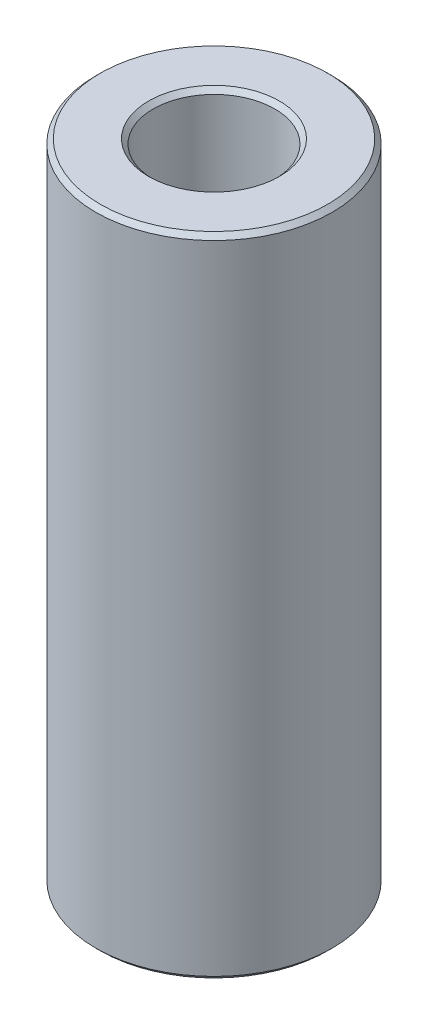
ISO-10303-21;
HEADER;
FILE_DESCRIPTION(('STEP AP214'),'2;1');
FILE_NAME('part.step','',(''),(''),'','','');
FILE_SCHEMA(('AUTOMOTIVE_DESIGN { 1 0 10303 214 1 1 1 1 }'));
ENDSEC;
DATA;
#1=APPLICATION_CONTEXT('core data for automotive mechanical design processes');
#2=APPLICATION_PROTOCOL_DEFINITION('international standard','automotive_design',2000,#1);
#3=PRODUCT_CONTEXT('',#1,'mechanical');
#4=PRODUCT('Part','Part','',(#3));
#5=PRODUCT_RELATED_PRODUCT_CATEGORY('part','',(#4));
#6=PRODUCT_DEFINITION_FORMATION('','',#4);
#7=PRODUCT_DEFINITION_CONTEXT('part definition',#1,'design');
#8=PRODUCT_DEFINITION('design','',#6,#7);
#9=PRODUCT_DEFINITION_SHAPE('','',#8);
#10=(LENGTH_UNIT() NAMED_UNIT(*) SI_UNIT(.MILLI.,.METRE.));
#11=(NAMED_UNIT(*) PLANE_ANGLE_UNIT() SI_UNIT($,.RADIAN.));
#12=(NAMED_UNIT(*) SI_UNIT($,.STERADIAN.) SOLID_ANGLE_UNIT());
#13=UNCERTAINTY_MEASURE_WITH_UNIT(LENGTH_MEASURE(1.E-05),#10,'distance_accuracy_value','');
#14=(GEOMETRIC_REPRESENTATION_CONTEXT(3) GLOBAL_UNCERTAINTY_ASSIGNED_CONTEXT((#13)) GLOBAL_UNIT_ASSIGNED_CONTEXT((#10,
#11,#12)) REPRESENTATION_CONTEXT('',''));
#15=CARTESIAN_POINT('',(0.,0.,0.));
#16=DIRECTION('',(0.,0.,1.));
#17=DIRECTION('',(1.,0.,0.));
#18=AXIS2_PLACEMENT_3D('',#15,#16,#17);
#19=CARTESIAN_POINT('',(0.,136.675771932376,0.));
#20=DIRECTION('',(0.,-1.,0.));
#21=DIRECTION('',(0.,0.,-1.));
#22=AXIS2_PLACEMENT_3D('',#19,#20,#21);
#23=CYLINDRICAL_SURFACE('',#22,25.);
#24=CARTESIAN_POINT('',(0.,0.972063220584823,0.));
#25=DIRECTION('',(0.,1.,0.));
#26=DIRECTION('',(0.,0.,1.));
#27=AXIS2_PLACEMENT_3D('',#24,#25,#26);
#28=CIRCLE('',#27,25.);
#29=CARTESIAN_POINT('',(0.,0.972063220584823,25.));
#30=VERTEX_POINT('',#29);
#31=EDGE_CURVE('E10',#30,#30,#28,.T.);
#32=ORIENTED_EDGE('',*,*,#31,.T.);
#33=EDGE_LOOP('',(#32));
#34=FACE_BOUND('',#33,.T.);
#35=CARTESIAN_POINT('',(0.,135.703708711791,0.));
#36=DIRECTION('',(0.,1.,0.));
#37=DIRECTION('',(0.,0.,1.));
#38=AXIS2_PLACEMENT_3D('',#35,#36,#37);
#39=CIRCLE('',#38,25.);
#40=CARTESIAN_POINT('',(0.,135.703708711791,25.));
#41=VERTEX_POINT('',#40);
#42=EDGE_CURVE('E50',#41,#41,#39,.F.);
#43=ORIENTED_EDGE('',*,*,#42,.T.);
#44=EDGE_LOOP('',(#43));
#45=FACE_BOUND('',#44,.T.);
#46=ADVANCED_FACE('F39',(#34,#45),#23,.T.);
#47=CARTESIAN_POINT('',(0.,136.675771932376,0.));
#48=DIRECTION('',(0.,1.,0.));
#49=DIRECTION('',(0.,0.,1.));
#50=AXIS2_PLACEMENT_3D('',#47,#48,#49);
#51=PLANE('',#50);
#52=CARTESIAN_POINT('',(0.,136.675771932376,0.));
#53=DIRECTION('',(0.,1.,0.));
#54=DIRECTION('',(0.,0.,1.));
#55=AXIS2_PLACEMENT_3D('',#52,#53,#54);
#56=CIRCLE('',#55,13.832782964475);
#57=CARTESIAN_POINT('',(0.,136.675771932376,13.832782964475));
#58=VERTEX_POINT('',#57);
#59=EDGE_CURVE('E58',#58,#58,#56,.F.);
#60=ORIENTED_EDGE('',*,*,#59,.T.);
#61=EDGE_LOOP('',(#60));
#62=FACE_BOUND('',#61,.T.);
#63=CARTESIAN_POINT('',(0.,136.675771932376,0.));
#64=DIRECTION('',(0.,1.,0.));
#65=DIRECTION('',(0.,0.,1.));
#66=AXIS2_PLACEMENT_3D('',#63,#64,#65);
#67=CIRCLE('',#66,24.0279367794152);
#68=CARTESIAN_POINT('',(0.,136.675771932376,24.0279367794152));
#69=VERTEX_POINT('',#68);
#70=EDGE_CURVE('E61',#69,#69,#67,.T.);
#71=ORIENTED_EDGE('',*,*,#70,.T.);
#72=EDGE_LOOP('',(#71));
#73=FACE_BOUND('',#72,.T.);
#74=ADVANCED_FACE('F88',(#62,#73),#51,.T.);
#75=CARTESIAN_POINT('',(0.,0.,0.));
#76=DIRECTION('',(0.,1.,0.));
#77=DIRECTION('',(0.,0.,1.));
#78=AXIS2_PLACEMENT_3D('',#75,#76,#77);
#79=PLANE('',#78);
#80=CARTESIAN_POINT('',(0.,0.,0.));
#81=DIRECTION('',(0.,1.,0.));
#82=DIRECTION('',(0.,0.,1.));
#83=AXIS2_PLACEMENT_3D('',#80,#81,#82);
#84=CIRCLE('',#83,13.8327829644749);
#85=CARTESIAN_POINT('',(0.,0.,13.8327829644749));
#86=VERTEX_POINT('',#85);
#87=EDGE_CURVE('E51',#86,#86,#84,.T.);
#88=ORIENTED_EDGE('',*,*,#87,.T.);
#89=EDGE_LOOP('',(#88));
#90=FACE_BOUND('',#89,.T.);
#91=CARTESIAN_POINT('',(0.,0.,0.));
#92=DIRECTION('',(0.,1.,0.));
#93=DIRECTION('',(0.,0.,1.));
#94=AXIS2_PLACEMENT_3D('',#91,#92,#93);
#95=CIRCLE('',#94,24.0279367794152);
#96=CARTESIAN_POINT('',(0.,0.,24.0279367794152));
#97=VERTEX_POINT('',#96);
#98=EDGE_CURVE('E54',#97,#97,#95,.F.);
#99=ORIENTED_EDGE('',*,*,#98,.T.);
#100=EDGE_LOOP('',(#99));
#101=FACE_BOUND('',#100,.T.);
#102=ADVANCED_FACE('F83',(#90,#101),#79,.F.);
#103=CARTESIAN_POINT('',(0.,136.675771932376,0.));
#104=DIRECTION('',(0.,-1.,0.));
#105=DIRECTION('',(0.,0.,-1.));
#106=AXIS2_PLACEMENT_3D('',#103,#104,#105);
#107=CYLINDRICAL_SURFACE('',#106,12.8607197438902);
#108=CARTESIAN_POINT('',(0.,135.703708711791,0.));
#109=DIRECTION('',(0.,1.,0.));
#110=DIRECTION('',(0.,0.,1.));
#111=AXIS2_PLACEMENT_3D('',#108,#109,#110);
#112=CIRCLE('',#111,12.8607197438902);
#113=CARTESIAN_POINT('',(0.,135.703708711791,12.8607197438901));
#114=VERTEX_POINT('',#113);
#115=EDGE_CURVE('E67',#114,#114,#112,.T.);
#116=ORIENTED_EDGE('',*,*,#115,.T.);
#117=EDGE_LOOP('',(#116));
#118=FACE_BOUND('',#117,.T.);
#119=CARTESIAN_POINT('',(0.,0.972063220584796,0.));
#120=DIRECTION('',(0.,1.,0.));
#121=DIRECTION('',(0.,0.,1.));
#122=AXIS2_PLACEMENT_3D('',#119,#120,#121);
#123=CIRCLE('',#122,12.8607197438902);
#124=CARTESIAN_POINT('',(0.,0.972063220584796,12.8607197438902));
#125=VERTEX_POINT('',#124);
#126=EDGE_CURVE('E69',#125,#125,#123,.F.);
#127=ORIENTED_EDGE('',*,*,#126,.T.);
#128=EDGE_LOOP('',(#127));
#129=FACE_BOUND('',#128,.T.);
#130=ADVANCED_FACE('F71',(#118,#129),#107,.F.);
#131=CARTESIAN_POINT('',(0.,135.703708711791,0.));
#132=DIRECTION('',(0.,1.,0.));
#133=DIRECTION('',(0.,0.,1.));
#134=AXIS2_PLACEMENT_3D('',#131,#132,#133);
#135=CONICAL_SURFACE('',#134,12.8607197438902,0.785398163397447);
#136=CARTESIAN_POINT('',(0.,136.675771932376,13.832782964475));
#137=CARTESIAN_POINT('',(0.,136.665646273828,13.8226573059272));
#138=CARTESIAN_POINT('',(0.,136.65552061528,13.8125316473795));
#139=CARTESIAN_POINT('',(0.,136.635269298185,13.792280330284));
#140=CARTESIAN_POINT('',(0.,136.625143639637,13.7821546717362));
#141=CARTESIAN_POINT('',(0.,136.604892322542,13.7619033546407));
#142=CARTESIAN_POINT('',(0.,136.594766663994,13.7517776960929));
#143=CARTESIAN_POINT('',(0.,136.574515346898,13.7315263789974));
#144=CARTESIAN_POINT('',(0.,136.564389688351,13.7214007204496));
#145=CARTESIAN_POINT('',(0.,136.544138371255,13.7011494033541));
#146=CARTESIAN_POINT('',(0.,136.534012712707,13.6910237448064));
#147=CARTESIAN_POINT('',(0.,136.513761395612,13.6707724277108));
#148=CARTESIAN_POINT('',(0.,136.503635737064,13.6606467691631));
#149=CARTESIAN_POINT('',(0.,136.483384419969,13.6403954520676));
#150=CARTESIAN_POINT('',(0.,136.473258761421,13.6302697935198));
#151=CARTESIAN_POINT('',(0.,136.453007444325,13.6100184764243));
#152=CARTESIAN_POINT('',(0.,136.442881785777,13.5998928178765));
#153=CARTESIAN_POINT('',(0.,136.422630468682,13.579641500781));
#154=CARTESIAN_POINT('',(0.,136.412504810134,13.5695158422333));
#155=CARTESIAN_POINT('',(0.,136.392253493039,13.5492645251377));
#156=CARTESIAN_POINT('',(0.,136.382127834491,13.53913886659));
#157=CARTESIAN_POINT('',(0.,136.361876517395,13.5188875494945));
#158=CARTESIAN_POINT('',(0.,136.351750858848,13.5087618909467));
#159=CARTESIAN_POINT('',(0.,136.331499541752,13.4885105738512));
#160=CARTESIAN_POINT('',(0.,136.321373883204,13.4783849153034));
#161=CARTESIAN_POINT('',(0.,136.301122566109,13.4581335982079));
#162=CARTESIAN_POINT('',(0.,136.290996907561,13.4480079396602));
#163=CARTESIAN_POINT('',(0.,136.270745590466,13.4277566225646));
#164=CARTESIAN_POINT('',(0.,136.260619931918,13.4176309640169));
#165=CARTESIAN_POINT('',(0.,136.240368614822,13.3973796469214));
#166=CARTESIAN_POINT('',(0.,136.230242956275,13.3872539883736));
#167=CARTESIAN_POINT('',(0.,136.209991639179,13.3670026712781));
#168=CARTESIAN_POINT('',(0.,136.199865980631,13.3568770127303));
#169=CARTESIAN_POINT('',(0.,136.179614663536,13.3366256956348));
#170=CARTESIAN_POINT('',(0.,136.169489004988,13.326500037087));
#171=CARTESIAN_POINT('',(0.,136.149237687892,13.3062487199915));
#172=CARTESIAN_POINT('',(0.,136.139112029345,13.2961230614438));
#173=CARTESIAN_POINT('',(0.,136.118860712249,13.2758717443483));
#174=CARTESIAN_POINT('',(0.,136.108735053701,13.2657460858005));
#175=CARTESIAN_POINT('',(0.,136.088483736606,13.245494768705));
#176=CARTESIAN_POINT('',(0.,136.078358078058,13.2353691101572));
#177=CARTESIAN_POINT('',(0.,136.058106760963,13.2151177930617));
#178=CARTESIAN_POINT('',(0.,136.047981102415,13.2049921345139));
#179=CARTESIAN_POINT('',(0.,136.027729785319,13.1847408174184));
#180=CARTESIAN_POINT('',(0.,136.017604126772,13.1746151588707));
#181=CARTESIAN_POINT('',(0.,135.997352809676,13.1543638417751));
#182=CARTESIAN_POINT('',(0.,135.987227151128,13.1442381832274));
#183=CARTESIAN_POINT('',(0.,135.966975834033,13.1239868661319));
#184=CARTESIAN_POINT('',(0.,135.956850175485,13.1138612075841));
#185=CARTESIAN_POINT('',(0.,135.93659885839,13.0936098904886));
#186=CARTESIAN_POINT('',(0.,135.926473199842,13.0834842319408));
#187=CARTESIAN_POINT('',(0.,135.906221882746,13.0632329148453));
#188=CARTESIAN_POINT('',(0.,135.896096224198,13.0531072562976));
#189=CARTESIAN_POINT('',(0.,135.875844907103,13.032855939202));
#190=CARTESIAN_POINT('',(0.,135.865719248555,13.0227302806543));
#191=CARTESIAN_POINT('',(0.,135.84546793146,13.0024789635588));
#192=CARTESIAN_POINT('',(0.,135.835342272912,12.992353305011));
#193=CARTESIAN_POINT('',(0.,135.815090955816,12.9721019879155));
#194=CARTESIAN_POINT('',(0.,135.804965297269,12.9619763293677));
#195=CARTESIAN_POINT('',(0.,135.784713980173,12.9417250122722));
#196=CARTESIAN_POINT('',(0.,135.774588321625,12.9315993537244));
#197=CARTESIAN_POINT('',(0.,135.75433700453,12.9113480366289));
#198=CARTESIAN_POINT('',(0.,135.744211345982,12.9012223780812));
#199=CARTESIAN_POINT('',(0.,135.723960028887,12.8809710609857));
#200=CARTESIAN_POINT('',(0.,135.713834370339,12.8708454024379));
#201=CARTESIAN_POINT('',(0.,135.703708711791,12.8607197438901));
#202=B_SPLINE_CURVE_WITH_KNOTS('',3,(#136,#137,#138,#139,#140,#141,#142,#143,#144,#145,#146,
#147,#148,#149,#150,#151,#152,#153,#154,#155,#156,#157,#158,#159,#160,#161,#162,#163,#164,#165,
#166,#167,#168,#169,#170,#171,#172,#173,#174,#175,#176,#177,#178,#179,#180,#181,#182,#183,#184,
#185,#186,#187,#188,#189,#190,#191,#192,#193,#194,#195,#196,#197,#198,#199,#200,#201),
.UNSPECIFIED.,.F.,.F.,(4,2,2,2,2,2,2,2,2,2,2,2,2,2,2,2,2,2,2,2,2,2,2,2,2,2,2,2,2,2,2,2,4),(0.,
0.0429595309386063,0.0859190618772126,0.128878592815799,0.171838123754406,0.214797654693012,
0.257757185631599,0.300716716570205,0.343676247508791,0.386635778447398,0.429595309386004,
0.472554840324591,0.515514371263197,0.558473902201803,0.60143343314039,0.644392964078996,
0.687352495017582,0.730312025956188,0.773271556894794,0.816231087833381,0.859190618771987,
0.902150149710594,0.94510968064918,0.988069211587787,1.03102874252639,1.07398827346498,
1.11694780440359,1.15990733534217,1.20286686628078,1.24582639721938,1.28878592815797,
1.33174545909658,1.37470499003516),.UNSPECIFIED.);
#203=EDGE_CURVE('BSEAM77',#58,#114,#202,.T.);
#204=ORIENTED_EDGE('',*,*,#59,.F.);
#205=ORIENTED_EDGE('',*,*,#115,.F.);
#206=ORIENTED_EDGE('',*,*,#203,.T.);
#207=ORIENTED_EDGE('',*,*,#203,.F.);
#208=EDGE_LOOP('',(#204,#206,#205,#207));
#209=FACE_BOUND('',#208,.T.);
#210=ADVANCED_FACE('F77',(#209),#135,.F.);
#211=CARTESIAN_POINT('',(0.,0.,0.));
#212=DIRECTION('',(0.,-1.,0.));
#213=DIRECTION('',(0.,0.,-1.));
#214=AXIS2_PLACEMENT_3D('',#211,#212,#213);
#215=CONICAL_SURFACE('',#214,13.8327829644749,0.785398163397447);
#216=ORIENTED_EDGE('',*,*,#126,.F.);
#217=EDGE_LOOP('',(#216));
#218=FACE_BOUND('',#217,.T.);
#219=ORIENTED_EDGE('',*,*,#87,.F.);
#220=EDGE_LOOP('',(#219));
#221=FACE_BOUND('',#220,.T.);
#222=ADVANCED_FACE('F73',(#218,#221),#215,.F.);
#223=CARTESIAN_POINT('',(0.,0.972063220584823,0.));
#224=DIRECTION('',(0.,1.,0.));
#225=DIRECTION('',(0.,0.,1.));
#226=AXIS2_PLACEMENT_3D('',#223,#224,#225);
#227=CONICAL_SURFACE('',#226,25.,0.785398163397443);
#228=ORIENTED_EDGE('',*,*,#98,.F.);
#229=EDGE_LOOP('',(#228));
#230=FACE_BOUND('',#229,.T.);
#231=ORIENTED_EDGE('',*,*,#31,.F.);
#232=EDGE_LOOP('',(#231));
#233=FACE_BOUND('',#232,.T.);
#234=ADVANCED_FACE('F76',(#230,#233),#227,.T.);
#235=CARTESIAN_POINT('',(0.,136.675771932376,0.));
#236=DIRECTION('',(0.,-1.,0.));
#237=DIRECTION('',(0.,0.,-1.));
#238=AXIS2_PLACEMENT_3D('',#235,#236,#237);
#239=CONICAL_SURFACE('',#238,24.0279367794152,0.78539816339745);
#240=ORIENTED_EDGE('',*,*,#42,.F.);
#241=EDGE_LOOP('',(#240));
#242=FACE_BOUND('',#241,.T.);
#243=ORIENTED_EDGE('',*,*,#70,.F.);
#244=EDGE_LOOP('',(#243));
#245=FACE_BOUND('',#244,.T.);
#246=ADVANCED_FACE('F45',(#242,#245),#239,.T.);
#247=CLOSED_SHELL('',(#46,#74,#102,#130,#210,#222,#234,#246));
#248=MANIFOLD_SOLID_BREP('B2',#247);
#249=ADVANCED_BREP_SHAPE_REPRESENTATION('',(#18,#248),#14);
#250=SHAPE_DEFINITION_REPRESENTATION(#9,#249);
ENDSEC;
END-ISO-10303-21;
